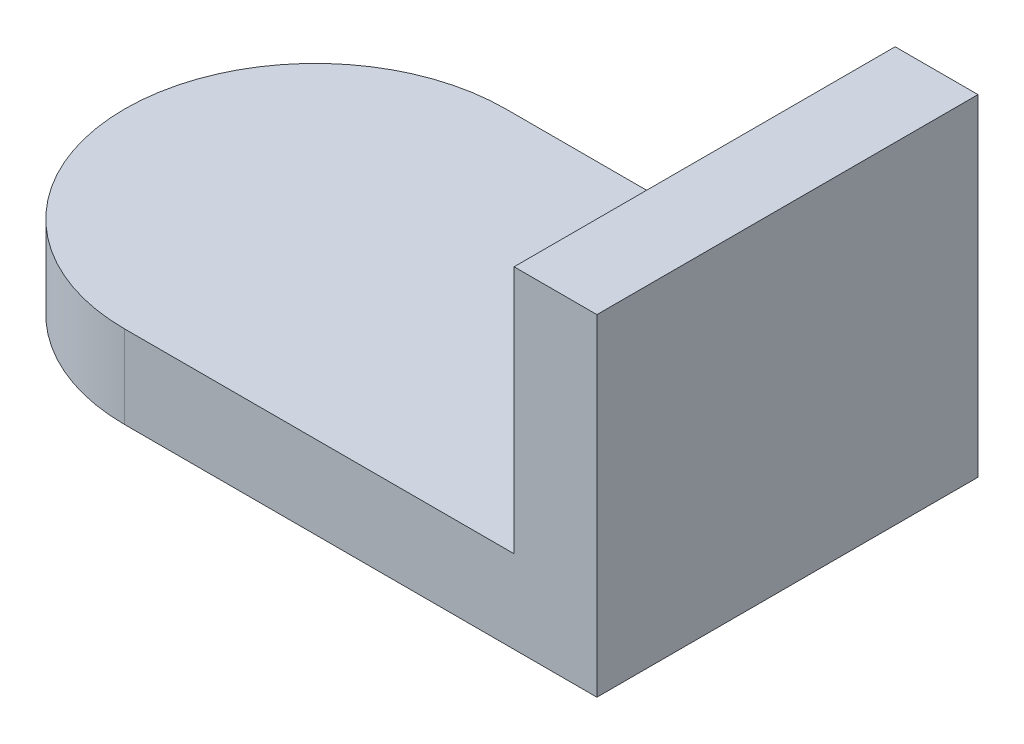
ISO-10303-21;
HEADER;
FILE_DESCRIPTION(('STEP AP214'),'2;1');
FILE_NAME('part.step','',(''),(''),'','','');
FILE_SCHEMA(('AUTOMOTIVE_DESIGN { 1 0 10303 214 1 1 1 1 }'));
ENDSEC;
DATA;
#1=APPLICATION_CONTEXT('core data for automotive mechanical design processes');
#2=APPLICATION_PROTOCOL_DEFINITION('international standard','automotive_design',2000,#1);
#3=PRODUCT_CONTEXT('',#1,'mechanical');
#4=PRODUCT('Part','Part','',(#3));
#5=PRODUCT_RELATED_PRODUCT_CATEGORY('part','',(#4));
#6=PRODUCT_DEFINITION_FORMATION('','',#4);
#7=PRODUCT_DEFINITION_CONTEXT('part definition',#1,'design');
#8=PRODUCT_DEFINITION('design','',#6,#7);
#9=PRODUCT_DEFINITION_SHAPE('','',#8);
#10=(LENGTH_UNIT() NAMED_UNIT(*) SI_UNIT(.MILLI.,.METRE.));
#11=(NAMED_UNIT(*) PLANE_ANGLE_UNIT() SI_UNIT($,.RADIAN.));
#12=(NAMED_UNIT(*) SI_UNIT($,.STERADIAN.) SOLID_ANGLE_UNIT());
#13=UNCERTAINTY_MEASURE_WITH_UNIT(LENGTH_MEASURE(1.E-05),#10,'distance_accuracy_value','');
#14=(GEOMETRIC_REPRESENTATION_CONTEXT(3) GLOBAL_UNCERTAINTY_ASSIGNED_CONTEXT((#13)) GLOBAL_UNIT_ASSIGNED_CONTEXT((#10,
#11,#12)) REPRESENTATION_CONTEXT('',''));
#15=CARTESIAN_POINT('',(0.,0.,0.));
#16=DIRECTION('',(0.,0.,1.));
#17=DIRECTION('',(1.,0.,0.));
#18=AXIS2_PLACEMENT_3D('',#15,#16,#17);
#19=CARTESIAN_POINT('',(1.45,-0.2,0.635000000000001));
#20=DIRECTION('',(0.,0.,-1.));
#21=DIRECTION('',(1.,0.,0.));
#22=AXIS2_PLACEMENT_3D('',#19,#20,#21);
#23=PLANE('',#22);
#24=DIRECTION('',(0.,-1.,0.));
#25=VECTOR('',#24,1.);
#26=CARTESIAN_POINT('',(1.5,-0.2,0.635000000000001));
#27=LINE('',#26,#25);
#28=CARTESIAN_POINT('',(1.5,-0.2,0.635000000000001));
#29=VERTEX_POINT('',#28);
#30=CARTESIAN_POINT('',(1.5,-0.4,0.635000000000001));
#31=VERTEX_POINT('',#30);
#32=EDGE_CURVE('E11',#29,#31,#27,.T.);
#33=ORIENTED_EDGE('',*,*,#32,.T.);
#34=DIRECTION('',(1.,0.,0.));
#35=VECTOR('',#34,1.);
#36=CARTESIAN_POINT('',(1.45,-0.4,0.635000000000001));
#37=LINE('',#36,#35);
#38=CARTESIAN_POINT('',(1.215,-0.4,0.635000000000001));
#39=VERTEX_POINT('',#38);
#40=EDGE_CURVE('E24',#39,#31,#37,.T.);
#41=ORIENTED_EDGE('',*,*,#40,.F.);
#42=DIRECTION('',(0.,-1.,0.));
#43=VECTOR('',#42,1.);
#44=CARTESIAN_POINT('',(1.215,-0.35,0.635000000000001));
#45=LINE('',#44,#43);
#46=CARTESIAN_POINT('',(1.215,-0.35,0.635000000000001));
#47=VERTEX_POINT('',#46);
#48=EDGE_CURVE('E86',#47,#39,#45,.T.);
#49=ORIENTED_EDGE('',*,*,#48,.F.);
#50=DIRECTION('',(-1.,0.,0.));
#51=VECTOR('',#50,1.);
#52=CARTESIAN_POINT('',(1.45,-0.35,0.635000000000001));
#53=LINE('',#52,#51);
#54=CARTESIAN_POINT('',(1.45,-0.35,0.635000000000001));
#55=VERTEX_POINT('',#54);
#56=EDGE_CURVE('E115',#55,#47,#53,.T.);
#57=ORIENTED_EDGE('',*,*,#56,.F.);
#58=DIRECTION('',(0.,-1.,0.));
#59=VECTOR('',#58,1.);
#60=CARTESIAN_POINT('',(1.45,-0.2,0.635000000000001));
#61=LINE('',#60,#59);
#62=CARTESIAN_POINT('',(1.45,-0.2,0.635000000000001));
#63=VERTEX_POINT('',#62);
#64=EDGE_CURVE('E112',#63,#55,#61,.T.);
#65=ORIENTED_EDGE('',*,*,#64,.F.);
#66=DIRECTION('',(1.,0.,0.));
#67=VECTOR('',#66,1.);
#68=CARTESIAN_POINT('',(1.45,-0.2,0.635000000000001));
#69=LINE('',#68,#67);
#70=EDGE_CURVE('E110',#63,#29,#69,.T.);
#71=ORIENTED_EDGE('',*,*,#70,.T.);
#72=EDGE_LOOP('',(#33,#41,#49,#57,#65,#71));
#73=FACE_BOUND('',#72,.T.);
#74=ADVANCED_FACE('F17',(#73),#23,.T.);
#75=CARTESIAN_POINT('',(1.45,-0.2,0.635000000000001));
#76=DIRECTION('',(0.,1.,0.));
#77=DIRECTION('',(0.,0.,1.));
#78=AXIS2_PLACEMENT_3D('',#75,#76,#77);
#79=PLANE('',#78);
#80=DIRECTION('',(0.,0.,-1.));
#81=VECTOR('',#80,1.);
#82=CARTESIAN_POINT('',(1.5,-0.2,0.635000000000001));
#83=LINE('',#82,#81);
#84=CARTESIAN_POINT('',(1.5,-0.2,0.865));
#85=VERTEX_POINT('',#84);
#86=EDGE_CURVE('E107',#85,#29,#83,.T.);
#87=ORIENTED_EDGE('',*,*,#86,.T.);
#88=ORIENTED_EDGE('',*,*,#70,.F.);
#89=DIRECTION('',(0.,0.,-1.));
#90=VECTOR('',#89,1.);
#91=CARTESIAN_POINT('',(1.45,-0.2,0.635000000000001));
#92=LINE('',#91,#90);
#93=CARTESIAN_POINT('',(1.45,-0.2,0.865));
#94=VERTEX_POINT('',#93);
#95=EDGE_CURVE('E104',#94,#63,#92,.T.);
#96=ORIENTED_EDGE('',*,*,#95,.F.);
#97=DIRECTION('',(1.,0.,0.));
#98=VECTOR('',#97,1.);
#99=CARTESIAN_POINT('',(1.45,-0.2,0.865));
#100=LINE('',#99,#98);
#101=EDGE_CURVE('E101',#94,#85,#100,.T.);
#102=ORIENTED_EDGE('',*,*,#101,.T.);
#103=EDGE_LOOP('',(#87,#88,#96,#102));
#104=FACE_BOUND('',#103,.T.);
#105=ADVANCED_FACE('F127',(#104),#79,.T.);
#106=CARTESIAN_POINT('',(1.45,-0.2,0.865));
#107=DIRECTION('',(0.,0.,1.));
#108=DIRECTION('',(0.,-1.,0.));
#109=AXIS2_PLACEMENT_3D('',#106,#107,#108);
#110=PLANE('',#109);
#111=DIRECTION('',(0.,1.,0.));
#112=VECTOR('',#111,1.);
#113=CARTESIAN_POINT('',(1.5,-0.2,0.865));
#114=LINE('',#113,#112);
#115=CARTESIAN_POINT('',(1.5,-0.4,0.865000000000001));
#116=VERTEX_POINT('',#115);
#117=EDGE_CURVE('E99',#116,#85,#114,.T.);
#118=ORIENTED_EDGE('',*,*,#117,.T.);
#119=ORIENTED_EDGE('',*,*,#101,.F.);
#120=DIRECTION('',(0.,1.,0.));
#121=VECTOR('',#120,1.);
#122=CARTESIAN_POINT('',(1.45,-0.2,0.865));
#123=LINE('',#122,#121);
#124=CARTESIAN_POINT('',(1.45,-0.35,0.865000000000001));
#125=VERTEX_POINT('',#124);
#126=EDGE_CURVE('E96',#125,#94,#123,.T.);
#127=ORIENTED_EDGE('',*,*,#126,.F.);
#128=DIRECTION('',(1.,0.,0.));
#129=VECTOR('',#128,1.);
#130=CARTESIAN_POINT('',(1.45,-0.35,0.865000000000001));
#131=LINE('',#130,#129);
#132=CARTESIAN_POINT('',(1.215,-0.35,0.865000000000001));
#133=VERTEX_POINT('',#132);
#134=EDGE_CURVE('E72',#133,#125,#131,.T.);
#135=ORIENTED_EDGE('',*,*,#134,.F.);
#136=DIRECTION('',(0.,-1.,0.));
#137=VECTOR('',#136,1.);
#138=CARTESIAN_POINT('',(1.215,-0.35,0.865000000000001));
#139=LINE('',#138,#137);
#140=CARTESIAN_POINT('',(1.215,-0.4,0.865000000000001));
#141=VERTEX_POINT('',#140);
#142=EDGE_CURVE('E65',#133,#141,#139,.T.);
#143=ORIENTED_EDGE('',*,*,#142,.T.);
#144=DIRECTION('',(1.,0.,0.));
#145=VECTOR('',#144,1.);
#146=CARTESIAN_POINT('',(1.45,-0.4,0.865000000000001));
#147=LINE('',#146,#145);
#148=EDGE_CURVE('E69',#141,#116,#147,.T.);
#149=ORIENTED_EDGE('',*,*,#148,.T.);
#150=EDGE_LOOP('',(#118,#119,#127,#135,#143,#149));
#151=FACE_BOUND('',#150,.T.);
#152=ADVANCED_FACE('F68',(#151),#110,.T.);
#153=CARTESIAN_POINT('',(1.45,-0.4,0.635000000000001));
#154=DIRECTION('',(0.,-1.,0.));
#155=DIRECTION('',(0.,0.,-1.));
#156=AXIS2_PLACEMENT_3D('',#153,#154,#155);
#157=PLANE('',#156);
#158=DIRECTION('',(0.,0.,1.));
#159=VECTOR('',#158,1.);
#160=CARTESIAN_POINT('',(1.5,-0.4,0.635000000000001));
#161=LINE('',#160,#159);
#162=EDGE_CURVE('E82',#31,#116,#161,.T.);
#163=ORIENTED_EDGE('',*,*,#162,.T.);
#164=ORIENTED_EDGE('',*,*,#148,.F.);
#165=CARTESIAN_POINT('',(1.215,-0.4,0.750000000000001));
#166=DIRECTION('',(0.,1.,0.));
#167=DIRECTION('',(0.,0.,1.));
#168=AXIS2_PLACEMENT_3D('',#165,#166,#167);
#169=CIRCLE('',#168,0.115);
#170=EDGE_CURVE('E81',#39,#141,#169,.T.);
#171=ORIENTED_EDGE('',*,*,#170,.F.);
#172=ORIENTED_EDGE('',*,*,#40,.T.);
#173=EDGE_LOOP('',(#163,#164,#171,#172));
#174=FACE_BOUND('',#173,.T.);
#175=ADVANCED_FACE('F80',(#174),#157,.T.);
#176=CARTESIAN_POINT('',(1.45,0.,0.));
#177=DIRECTION('',(1.,0.,0.));
#178=DIRECTION('',(0.,0.,1.));
#179=AXIS2_PLACEMENT_3D('',#176,#177,#178);
#180=PLANE('',#179);
#181=ORIENTED_EDGE('',*,*,#126,.T.);
#182=ORIENTED_EDGE('',*,*,#95,.T.);
#183=ORIENTED_EDGE('',*,*,#64,.T.);
#184=DIRECTION('',(0.,0.,-1.));
#185=VECTOR('',#184,1.);
#186=CARTESIAN_POINT('',(1.45,-0.35,0.635000000000001));
#187=LINE('',#186,#185);
#188=EDGE_CURVE('E87',#125,#55,#187,.T.);
#189=ORIENTED_EDGE('',*,*,#188,.F.);
#190=EDGE_LOOP('',(#181,#182,#183,#189));
#191=FACE_BOUND('',#190,.T.);
#192=ADVANCED_FACE('F123',(#191),#180,.F.);
#193=CARTESIAN_POINT('',(1.5,0.,0.));
#194=DIRECTION('',(1.,0.,0.));
#195=DIRECTION('',(0.,0.,1.));
#196=AXIS2_PLACEMENT_3D('',#193,#194,#195);
#197=PLANE('',#196);
#198=ORIENTED_EDGE('',*,*,#32,.F.);
#199=ORIENTED_EDGE('',*,*,#86,.F.);
#200=ORIENTED_EDGE('',*,*,#117,.F.);
#201=ORIENTED_EDGE('',*,*,#162,.F.);
#202=EDGE_LOOP('',(#198,#199,#200,#201));
#203=FACE_BOUND('',#202,.T.);
#204=ADVANCED_FACE('F118',(#203),#197,.T.);
#205=CARTESIAN_POINT('',(1.215,-0.35,0.750000000000001));
#206=DIRECTION('',(0.,-1.,0.));
#207=DIRECTION('',(0.,0.,-1.));
#208=AXIS2_PLACEMENT_3D('',#205,#206,#207);
#209=CYLINDRICAL_SURFACE('',#208,0.115);
#210=ORIENTED_EDGE('',*,*,#170,.T.);
#211=ORIENTED_EDGE('',*,*,#142,.F.);
#212=CARTESIAN_POINT('',(1.215,-0.35,0.750000000000001));
#213=DIRECTION('',(0.,1.,0.));
#214=DIRECTION('',(0.,0.,1.));
#215=AXIS2_PLACEMENT_3D('',#212,#213,#214);
#216=CIRCLE('',#215,0.115);
#217=EDGE_CURVE('E91',#47,#133,#216,.T.);
#218=ORIENTED_EDGE('',*,*,#217,.F.);
#219=ORIENTED_EDGE('',*,*,#48,.T.);
#220=EDGE_LOOP('',(#210,#211,#218,#219));
#221=FACE_BOUND('',#220,.T.);
#222=ADVANCED_FACE('F85',(#221),#209,.T.);
#223=CARTESIAN_POINT('',(1.215,-0.35,0.750000000000001));
#224=DIRECTION('',(0.,1.,0.));
#225=DIRECTION('',(0.,0.,1.));
#226=AXIS2_PLACEMENT_3D('',#223,#224,#225);
#227=PLANE('',#226);
#228=ORIENTED_EDGE('',*,*,#188,.T.);
#229=ORIENTED_EDGE('',*,*,#56,.T.);
#230=ORIENTED_EDGE('',*,*,#217,.T.);
#231=ORIENTED_EDGE('',*,*,#134,.T.);
#232=EDGE_LOOP('',(#228,#229,#230,#231));
#233=FACE_BOUND('',#232,.T.);
#234=ADVANCED_FACE('F125',(#233),#227,.T.);
#235=CLOSED_SHELL('',(#74,#105,#152,#175,#192,#204,#222,#234));
#236=MANIFOLD_SOLID_BREP('B1',#235);
#237=ADVANCED_BREP_SHAPE_REPRESENTATION('',(#18,#236),#14);
#238=SHAPE_DEFINITION_REPRESENTATION(#9,#237);
ENDSEC;
END-ISO-10303-21;
